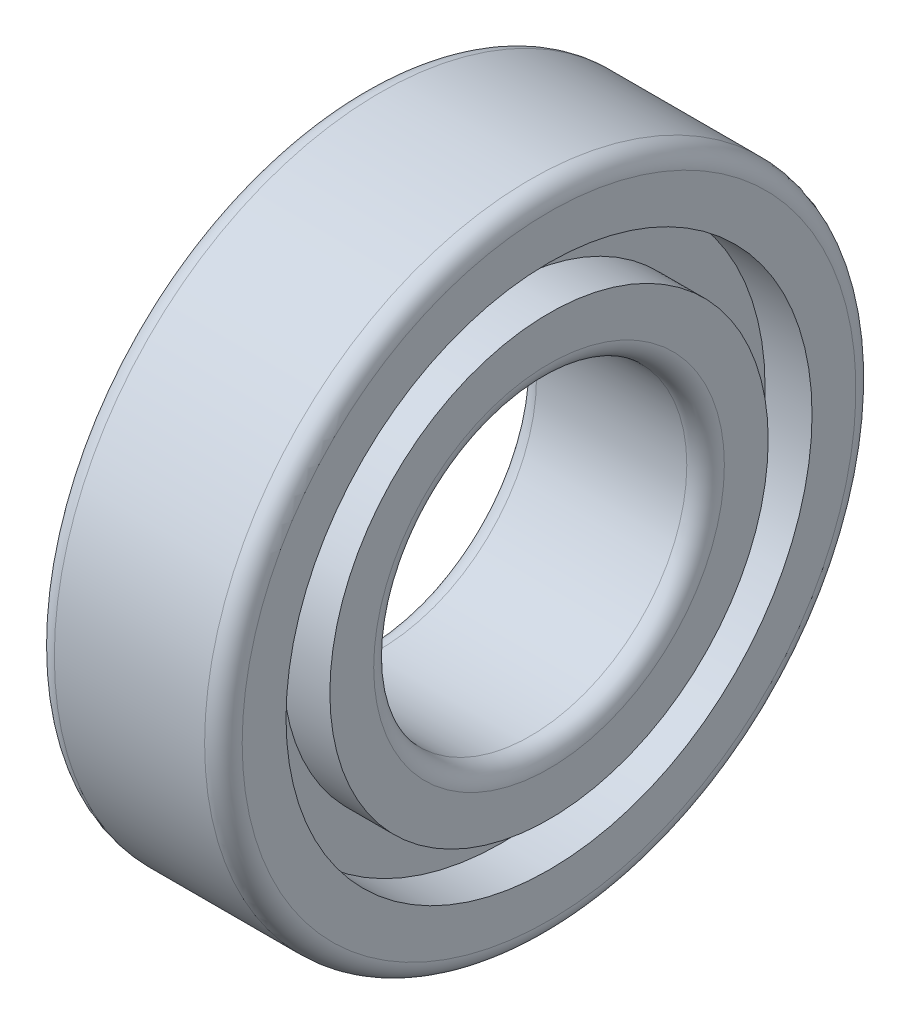
ISO-10303-21;
HEADER;
FILE_DESCRIPTION(('STEP AP214'),'2;1');
FILE_NAME('part.step','',(''),(''),'','','');
FILE_SCHEMA(('AUTOMOTIVE_DESIGN { 1 0 10303 214 1 1 1 1 }'));
ENDSEC;
DATA;
#1=APPLICATION_CONTEXT('core data for automotive mechanical design processes');
#2=APPLICATION_PROTOCOL_DEFINITION('international standard','automotive_design',2000,#1);
#3=PRODUCT_CONTEXT('',#1,'mechanical');
#4=PRODUCT('Part','Part','',(#3));
#5=PRODUCT_RELATED_PRODUCT_CATEGORY('part','',(#4));
#6=PRODUCT_DEFINITION_FORMATION('','',#4);
#7=PRODUCT_DEFINITION_CONTEXT('part definition',#1,'design');
#8=PRODUCT_DEFINITION('design','',#6,#7);
#9=PRODUCT_DEFINITION_SHAPE('','',#8);
#10=(LENGTH_UNIT() NAMED_UNIT(*) SI_UNIT(.MILLI.,.METRE.));
#11=(NAMED_UNIT(*) PLANE_ANGLE_UNIT() SI_UNIT($,.RADIAN.));
#12=(NAMED_UNIT(*) SI_UNIT($,.STERADIAN.) SOLID_ANGLE_UNIT());
#13=UNCERTAINTY_MEASURE_WITH_UNIT(LENGTH_MEASURE(1.E-05),#10,'distance_accuracy_value','');
#14=(GEOMETRIC_REPRESENTATION_CONTEXT(3) GLOBAL_UNCERTAINTY_ASSIGNED_CONTEXT((#13)) GLOBAL_UNIT_ASSIGNED_CONTEXT((#10,
#11,#12)) REPRESENTATION_CONTEXT('',''));
#15=CARTESIAN_POINT('',(0.,0.,0.));
#16=DIRECTION('',(0.,0.,1.));
#17=DIRECTION('',(1.,0.,0.));
#18=AXIS2_PLACEMENT_3D('',#15,#16,#17);
#19=CARTESIAN_POINT('',(-873.991742101089,0.,0.));
#20=DIRECTION('',(-1.,0.,0.));
#21=DIRECTION('',(0.,0.,1.));
#22=AXIS2_PLACEMENT_3D('',#19,#20,#21);
#23=CYLINDRICAL_SURFACE('',#22,17.5);
#24=CARTESIAN_POINT('',(-7.49999999999995,0.,0.));
#25=DIRECTION('',(-1.,0.,0.));
#26=DIRECTION('',(0.,0.,1.));
#27=AXIS2_PLACEMENT_3D('',#24,#25,#26);
#28=CIRCLE('',#27,17.5);
#29=CARTESIAN_POINT('',(-7.49999999999995,0.,17.5));
#30=VERTEX_POINT('',#29);
#31=EDGE_CURVE('E94',#30,#30,#28,.T.);
#32=ORIENTED_EDGE('',*,*,#31,.F.);
#33=EDGE_LOOP('',(#32));
#34=FACE_BOUND('',#33,.T.);
#35=CARTESIAN_POINT('',(-3.75000000000003,0.,0.));
#36=DIRECTION('',(-1.,0.,0.));
#37=DIRECTION('',(0.,0.,1.));
#38=AXIS2_PLACEMENT_3D('',#35,#36,#37);
#39=CIRCLE('',#38,17.5);
#40=CARTESIAN_POINT('',(-3.75000000000003,0.,17.5));
#41=VERTEX_POINT('',#40);
#42=EDGE_CURVE('E12',#41,#41,#39,.T.);
#43=ORIENTED_EDGE('',*,*,#42,.T.);
#44=EDGE_LOOP('',(#43));
#45=FACE_BOUND('',#44,.T.);
#46=ADVANCED_FACE('F42',(#34,#45),#23,.T.);
#47=CARTESIAN_POINT('',(-3.75,17.5,0.));
#48=DIRECTION('',(1.,0.,0.));
#49=DIRECTION('',(0.,0.,-1.));
#50=AXIS2_PLACEMENT_3D('',#47,#48,#49);
#51=PLANE('',#50);
#52=ORIENTED_EDGE('',*,*,#42,.F.);
#53=EDGE_LOOP('',(#52));
#54=FACE_BOUND('',#53,.T.);
#55=CARTESIAN_POINT('',(-3.75000000000003,0.,0.));
#56=DIRECTION('',(-1.,0.,0.));
#57=DIRECTION('',(0.,0.,1.));
#58=AXIS2_PLACEMENT_3D('',#55,#56,#57);
#59=CIRCLE('',#58,21.);
#60=CARTESIAN_POINT('',(-3.75000000000003,0.,21.));
#61=VERTEX_POINT('',#60);
#62=EDGE_CURVE('E48',#61,#61,#59,.T.);
#63=ORIENTED_EDGE('',*,*,#62,.T.);
#64=EDGE_LOOP('',(#63));
#65=FACE_BOUND('',#64,.T.);
#66=ADVANCED_FACE('F101',(#54,#65),#51,.F.);
#67=CARTESIAN_POINT('',(-873.991742101089,0.,0.));
#68=DIRECTION('',(-1.,0.,0.));
#69=DIRECTION('',(0.,0.,1.));
#70=AXIS2_PLACEMENT_3D('',#67,#68,#69);
#71=CYLINDRICAL_SURFACE('',#70,21.);
#72=ORIENTED_EDGE('',*,*,#62,.F.);
#73=EDGE_LOOP('',(#72));
#74=FACE_BOUND('',#73,.T.);
#75=CARTESIAN_POINT('',(-7.49999999999995,0.,0.));
#76=DIRECTION('',(-1.,0.,0.));
#77=DIRECTION('',(0.,0.,1.));
#78=AXIS2_PLACEMENT_3D('',#75,#76,#77);
#79=CIRCLE('',#78,21.);
#80=CARTESIAN_POINT('',(-7.49999999999995,0.,21.));
#81=VERTEX_POINT('',#80);
#82=EDGE_CURVE('E52',#81,#81,#79,.T.);
#83=ORIENTED_EDGE('',*,*,#82,.T.);
#84=EDGE_LOOP('',(#83));
#85=FACE_BOUND('',#84,.T.);
#86=ADVANCED_FACE('F105',(#74,#85),#71,.F.);
#87=CARTESIAN_POINT('',(-7.5,21.,0.));
#88=DIRECTION('',(1.,0.,0.));
#89=DIRECTION('',(0.,0.,-1.));
#90=AXIS2_PLACEMENT_3D('',#87,#88,#89);
#91=PLANE('',#90);
#92=ORIENTED_EDGE('',*,*,#82,.F.);
#93=EDGE_LOOP('',(#92));
#94=FACE_BOUND('',#93,.T.);
#95=CARTESIAN_POINT('',(-7.49999999999995,0.,0.));
#96=DIRECTION('',(-1.,0.,0.));
#97=DIRECTION('',(0.,0.,1.));
#98=AXIS2_PLACEMENT_3D('',#95,#96,#97);
#99=CIRCLE('',#98,24.5);
#100=CARTESIAN_POINT('',(-7.49999999999995,0.,24.5));
#101=VERTEX_POINT('',#100);
#102=EDGE_CURVE('E56',#101,#101,#99,.T.);
#103=ORIENTED_EDGE('',*,*,#102,.T.);
#104=EDGE_LOOP('',(#103));
#105=FACE_BOUND('',#104,.T.);
#106=ADVANCED_FACE('F110',(#94,#105),#91,.F.);
#107=CARTESIAN_POINT('',(-6.,0.,0.));
#108=DIRECTION('',(-1.,0.,0.));
#109=DIRECTION('',(0.,0.,1.));
#110=AXIS2_PLACEMENT_3D('',#107,#108,#109);
#111=TOROIDAL_SURFACE('',#110,24.5,1.5);
#112=ORIENTED_EDGE('',*,*,#102,.F.);
#113=EDGE_LOOP('',(#112));
#114=FACE_BOUND('',#113,.T.);
#115=CARTESIAN_POINT('',(-6.00000000000001,0.,0.));
#116=DIRECTION('',(-1.,0.,0.));
#117=DIRECTION('',(0.,0.,1.));
#118=AXIS2_PLACEMENT_3D('',#115,#116,#117);
#119=CIRCLE('',#118,26.);
#120=CARTESIAN_POINT('',(-6.00000000000001,0.,26.));
#121=VERTEX_POINT('',#120);
#122=EDGE_CURVE('E61',#121,#121,#119,.T.);
#123=ORIENTED_EDGE('',*,*,#122,.T.);
#124=EDGE_LOOP('',(#123));
#125=FACE_BOUND('',#124,.T.);
#126=ADVANCED_FACE('F116',(#114,#125),#111,.T.);
#127=CARTESIAN_POINT('',(-873.991742101089,0.,0.));
#128=DIRECTION('',(-1.,0.,0.));
#129=DIRECTION('',(0.,0.,1.));
#130=AXIS2_PLACEMENT_3D('',#127,#128,#129);
#131=CYLINDRICAL_SURFACE('',#130,26.);
#132=ORIENTED_EDGE('',*,*,#122,.F.);
#133=EDGE_LOOP('',(#132));
#134=FACE_BOUND('',#133,.T.);
#135=CARTESIAN_POINT('',(6.00000000000001,0.,0.));
#136=DIRECTION('',(-1.,0.,0.));
#137=DIRECTION('',(0.,0.,1.));
#138=AXIS2_PLACEMENT_3D('',#135,#136,#137);
#139=CIRCLE('',#138,26.);
#140=CARTESIAN_POINT('',(6.00000000000001,0.,26.));
#141=VERTEX_POINT('',#140);
#142=EDGE_CURVE('E64',#141,#141,#139,.T.);
#143=ORIENTED_EDGE('',*,*,#142,.T.);
#144=EDGE_LOOP('',(#143));
#145=FACE_BOUND('',#144,.T.);
#146=ADVANCED_FACE('F120',(#134,#145),#131,.T.);
#147=CARTESIAN_POINT('',(6.,0.,0.));
#148=DIRECTION('',(-1.,0.,0.));
#149=DIRECTION('',(0.,0.,1.));
#150=AXIS2_PLACEMENT_3D('',#147,#148,#149);
#151=TOROIDAL_SURFACE('',#150,24.5,1.5);
#152=ORIENTED_EDGE('',*,*,#142,.F.);
#153=EDGE_LOOP('',(#152));
#154=FACE_BOUND('',#153,.T.);
#155=CARTESIAN_POINT('',(7.49999999999995,0.,0.));
#156=DIRECTION('',(-1.,0.,0.));
#157=DIRECTION('',(0.,0.,1.));
#158=AXIS2_PLACEMENT_3D('',#155,#156,#157);
#159=CIRCLE('',#158,24.5);
#160=CARTESIAN_POINT('',(7.49999999999995,0.,24.5));
#161=VERTEX_POINT('',#160);
#162=EDGE_CURVE('E67',#161,#161,#159,.T.);
#163=ORIENTED_EDGE('',*,*,#162,.T.);
#164=EDGE_LOOP('',(#163));
#165=FACE_BOUND('',#164,.T.);
#166=ADVANCED_FACE('F124',(#154,#165),#151,.T.);
#167=CARTESIAN_POINT('',(7.5,21.,0.));
#168=DIRECTION('',(-1.,0.,0.));
#169=DIRECTION('',(0.,0.,1.));
#170=AXIS2_PLACEMENT_3D('',#167,#168,#169);
#171=PLANE('',#170);
#172=ORIENTED_EDGE('',*,*,#162,.F.);
#173=EDGE_LOOP('',(#172));
#174=FACE_BOUND('',#173,.T.);
#175=CARTESIAN_POINT('',(7.49999999999995,0.,0.));
#176=DIRECTION('',(-1.,0.,0.));
#177=DIRECTION('',(0.,0.,1.));
#178=AXIS2_PLACEMENT_3D('',#175,#176,#177);
#179=CIRCLE('',#178,21.);
#180=CARTESIAN_POINT('',(7.49999999999995,0.,21.));
#181=VERTEX_POINT('',#180);
#182=EDGE_CURVE('E70',#181,#181,#179,.T.);
#183=ORIENTED_EDGE('',*,*,#182,.T.);
#184=EDGE_LOOP('',(#183));
#185=FACE_BOUND('',#184,.T.);
#186=ADVANCED_FACE('F128',(#174,#185),#171,.F.);
#187=CARTESIAN_POINT('',(-873.991742101089,0.,0.));
#188=DIRECTION('',(-1.,0.,0.));
#189=DIRECTION('',(0.,0.,1.));
#190=AXIS2_PLACEMENT_3D('',#187,#188,#189);
#191=CYLINDRICAL_SURFACE('',#190,21.);
#192=ORIENTED_EDGE('',*,*,#182,.F.);
#193=EDGE_LOOP('',(#192));
#194=FACE_BOUND('',#193,.T.);
#195=CARTESIAN_POINT('',(3.75000000000003,0.,0.));
#196=DIRECTION('',(-1.,0.,0.));
#197=DIRECTION('',(0.,0.,1.));
#198=AXIS2_PLACEMENT_3D('',#195,#196,#197);
#199=CIRCLE('',#198,21.);
#200=CARTESIAN_POINT('',(3.75000000000003,0.,21.));
#201=VERTEX_POINT('',#200);
#202=EDGE_CURVE('E73',#201,#201,#199,.T.);
#203=ORIENTED_EDGE('',*,*,#202,.T.);
#204=EDGE_LOOP('',(#203));
#205=FACE_BOUND('',#204,.T.);
#206=ADVANCED_FACE('F132',(#194,#205),#191,.F.);
#207=CARTESIAN_POINT('',(3.75,17.5,0.));
#208=DIRECTION('',(-1.,0.,0.));
#209=DIRECTION('',(0.,0.,1.));
#210=AXIS2_PLACEMENT_3D('',#207,#208,#209);
#211=PLANE('',#210);
#212=ORIENTED_EDGE('',*,*,#202,.F.);
#213=EDGE_LOOP('',(#212));
#214=FACE_BOUND('',#213,.T.);
#215=CARTESIAN_POINT('',(3.75000000000003,0.,0.));
#216=DIRECTION('',(-1.,0.,0.));
#217=DIRECTION('',(0.,0.,1.));
#218=AXIS2_PLACEMENT_3D('',#215,#216,#217);
#219=CIRCLE('',#218,17.5);
#220=CARTESIAN_POINT('',(3.75000000000003,0.,17.5));
#221=VERTEX_POINT('',#220);
#222=EDGE_CURVE('E76',#221,#221,#219,.T.);
#223=ORIENTED_EDGE('',*,*,#222,.T.);
#224=EDGE_LOOP('',(#223));
#225=FACE_BOUND('',#224,.T.);
#226=ADVANCED_FACE('F136',(#214,#225),#211,.F.);
#227=CARTESIAN_POINT('',(-873.991742101089,0.,0.));
#228=DIRECTION('',(-1.,0.,0.));
#229=DIRECTION('',(0.,0.,1.));
#230=AXIS2_PLACEMENT_3D('',#227,#228,#229);
#231=CYLINDRICAL_SURFACE('',#230,17.5);
#232=ORIENTED_EDGE('',*,*,#222,.F.);
#233=EDGE_LOOP('',(#232));
#234=FACE_BOUND('',#233,.T.);
#235=CARTESIAN_POINT('',(7.49999999999995,0.,0.));
#236=DIRECTION('',(-1.,0.,0.));
#237=DIRECTION('',(0.,0.,1.));
#238=AXIS2_PLACEMENT_3D('',#235,#236,#237);
#239=CIRCLE('',#238,17.5);
#240=CARTESIAN_POINT('',(7.49999999999995,0.,17.5));
#241=VERTEX_POINT('',#240);
#242=EDGE_CURVE('E79',#241,#241,#239,.T.);
#243=ORIENTED_EDGE('',*,*,#242,.T.);
#244=EDGE_LOOP('',(#243));
#245=FACE_BOUND('',#244,.T.);
#246=ADVANCED_FACE('F140',(#234,#245),#231,.T.);
#247=CARTESIAN_POINT('',(7.5,14.,0.));
#248=DIRECTION('',(-1.,0.,0.));
#249=DIRECTION('',(0.,0.,1.));
#250=AXIS2_PLACEMENT_3D('',#247,#248,#249);
#251=PLANE('',#250);
#252=ORIENTED_EDGE('',*,*,#242,.F.);
#253=EDGE_LOOP('',(#252));
#254=FACE_BOUND('',#253,.T.);
#255=CARTESIAN_POINT('',(7.49999999999995,0.,0.));
#256=DIRECTION('',(-1.,0.,0.));
#257=DIRECTION('',(0.,0.,1.));
#258=AXIS2_PLACEMENT_3D('',#255,#256,#257);
#259=CIRCLE('',#258,14.);
#260=CARTESIAN_POINT('',(7.49999999999995,0.,14.));
#261=VERTEX_POINT('',#260);
#262=EDGE_CURVE('E82',#261,#261,#259,.T.);
#263=ORIENTED_EDGE('',*,*,#262,.T.);
#264=EDGE_LOOP('',(#263));
#265=FACE_BOUND('',#264,.T.);
#266=ADVANCED_FACE('F144',(#254,#265),#251,.F.);
#267=CARTESIAN_POINT('',(6.,0.,0.));
#268=DIRECTION('',(-1.,0.,0.));
#269=DIRECTION('',(0.,0.,1.));
#270=AXIS2_PLACEMENT_3D('',#267,#268,#269);
#271=TOROIDAL_SURFACE('',#270,14.,1.5);
#272=ORIENTED_EDGE('',*,*,#262,.F.);
#273=EDGE_LOOP('',(#272));
#274=FACE_BOUND('',#273,.T.);
#275=CARTESIAN_POINT('',(6.00000000000001,0.,0.));
#276=DIRECTION('',(-1.,0.,0.));
#277=DIRECTION('',(0.,0.,1.));
#278=AXIS2_PLACEMENT_3D('',#275,#276,#277);
#279=CIRCLE('',#278,12.5);
#280=CARTESIAN_POINT('',(6.00000000000001,0.,12.5));
#281=VERTEX_POINT('',#280);
#282=EDGE_CURVE('E85',#281,#281,#279,.T.);
#283=ORIENTED_EDGE('',*,*,#282,.T.);
#284=EDGE_LOOP('',(#283));
#285=FACE_BOUND('',#284,.T.);
#286=ADVANCED_FACE('F148',(#274,#285),#271,.T.);
#287=CARTESIAN_POINT('',(-873.991742101089,0.,0.));
#288=DIRECTION('',(-1.,0.,0.));
#289=DIRECTION('',(0.,0.,1.));
#290=AXIS2_PLACEMENT_3D('',#287,#288,#289);
#291=CYLINDRICAL_SURFACE('',#290,12.5);
#292=ORIENTED_EDGE('',*,*,#282,.F.);
#293=EDGE_LOOP('',(#292));
#294=FACE_BOUND('',#293,.T.);
#295=CARTESIAN_POINT('',(-6.00000000000001,0.,0.));
#296=DIRECTION('',(-1.,0.,0.));
#297=DIRECTION('',(0.,0.,1.));
#298=AXIS2_PLACEMENT_3D('',#295,#296,#297);
#299=CIRCLE('',#298,12.5);
#300=CARTESIAN_POINT('',(-6.00000000000001,0.,12.5));
#301=VERTEX_POINT('',#300);
#302=EDGE_CURVE('E88',#301,#301,#299,.T.);
#303=ORIENTED_EDGE('',*,*,#302,.T.);
#304=EDGE_LOOP('',(#303));
#305=FACE_BOUND('',#304,.T.);
#306=ADVANCED_FACE('F152',(#294,#305),#291,.F.);
#307=CARTESIAN_POINT('',(-6.,0.,0.));
#308=DIRECTION('',(-1.,0.,0.));
#309=DIRECTION('',(0.,0.,1.));
#310=AXIS2_PLACEMENT_3D('',#307,#308,#309);
#311=TOROIDAL_SURFACE('',#310,14.,1.5);
#312=ORIENTED_EDGE('',*,*,#302,.F.);
#313=EDGE_LOOP('',(#312));
#314=FACE_BOUND('',#313,.T.);
#315=CARTESIAN_POINT('',(-7.49999999999995,0.,0.));
#316=DIRECTION('',(-1.,0.,0.));
#317=DIRECTION('',(0.,0.,1.));
#318=AXIS2_PLACEMENT_3D('',#315,#316,#317);
#319=CIRCLE('',#318,14.);
#320=CARTESIAN_POINT('',(-7.49999999999995,0.,14.));
#321=VERTEX_POINT('',#320);
#322=EDGE_CURVE('E91',#321,#321,#319,.T.);
#323=ORIENTED_EDGE('',*,*,#322,.T.);
#324=EDGE_LOOP('',(#323));
#325=FACE_BOUND('',#324,.T.);
#326=ADVANCED_FACE('F156',(#314,#325),#311,.T.);
#327=CARTESIAN_POINT('',(-7.5,14.,0.));
#328=DIRECTION('',(1.,0.,0.));
#329=DIRECTION('',(0.,0.,-1.));
#330=AXIS2_PLACEMENT_3D('',#327,#328,#329);
#331=PLANE('',#330);
#332=ORIENTED_EDGE('',*,*,#322,.F.);
#333=EDGE_LOOP('',(#332));
#334=FACE_BOUND('',#333,.T.);
#335=ORIENTED_EDGE('',*,*,#31,.T.);
#336=EDGE_LOOP('',(#335));
#337=FACE_BOUND('',#336,.T.);
#338=ADVANCED_FACE('F98',(#334,#337),#331,.F.);
#339=CLOSED_SHELL('',(#46,#66,#86,#106,#126,#146,#166,#186,#206,#226,#246,#266,#286,#306,#326,#338));
#340=MANIFOLD_SOLID_BREP('B2',#339);
#341=ADVANCED_BREP_SHAPE_REPRESENTATION('',(#18,#340),#14);
#342=SHAPE_DEFINITION_REPRESENTATION(#9,#341);
ENDSEC;
END-ISO-10303-21;
